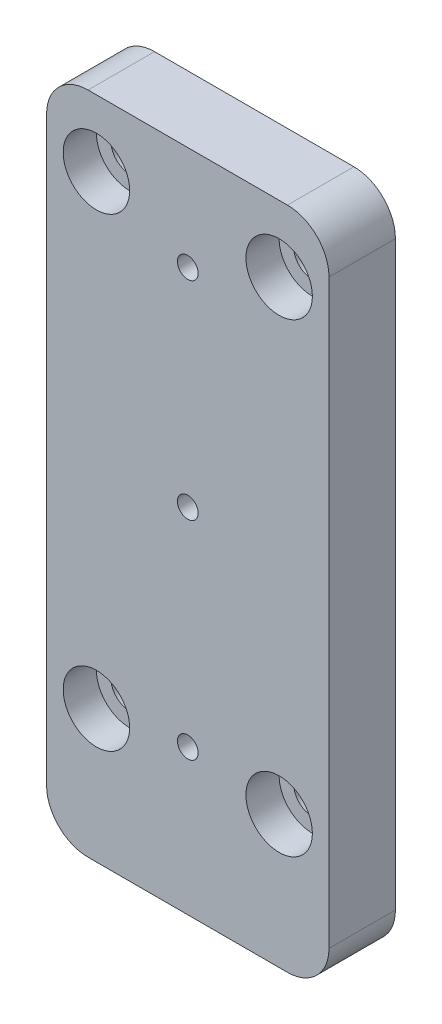
ISO-10303-21;
HEADER;
FILE_DESCRIPTION(('STEP AP214'),'2;1');
FILE_NAME('part.step','',(''),(''),'','','');
FILE_SCHEMA(('AUTOMOTIVE_DESIGN { 1 0 10303 214 1 1 1 1 }'));
ENDSEC;
DATA;
#1=APPLICATION_CONTEXT('core data for automotive mechanical design processes');
#2=APPLICATION_PROTOCOL_DEFINITION('international standard','automotive_design',2000,#1);
#3=PRODUCT_CONTEXT('',#1,'mechanical');
#4=PRODUCT('Part','Part','',(#3));
#5=PRODUCT_RELATED_PRODUCT_CATEGORY('part','',(#4));
#6=PRODUCT_DEFINITION_FORMATION('','',#4);
#7=PRODUCT_DEFINITION_CONTEXT('part definition',#1,'design');
#8=PRODUCT_DEFINITION('design','',#6,#7);
#9=PRODUCT_DEFINITION_SHAPE('','',#8);
#10=(LENGTH_UNIT() NAMED_UNIT(*) SI_UNIT(.MILLI.,.METRE.));
#11=(NAMED_UNIT(*) PLANE_ANGLE_UNIT() SI_UNIT($,.RADIAN.));
#12=(NAMED_UNIT(*) SI_UNIT($,.STERADIAN.) SOLID_ANGLE_UNIT());
#13=UNCERTAINTY_MEASURE_WITH_UNIT(LENGTH_MEASURE(1.E-05),#10,'distance_accuracy_value','');
#14=(GEOMETRIC_REPRESENTATION_CONTEXT(3) GLOBAL_UNCERTAINTY_ASSIGNED_CONTEXT((#13)) GLOBAL_UNIT_ASSIGNED_CONTEXT((#10,
#11,#12)) REPRESENTATION_CONTEXT('',''));
#15=CARTESIAN_POINT('',(0.,0.,0.));
#16=DIRECTION('',(0.,0.,1.));
#17=DIRECTION('',(1.,0.,0.));
#18=AXIS2_PLACEMENT_3D('',#15,#16,#17);
#19=CARTESIAN_POINT('',(6.,72.,0.));
#20=DIRECTION('',(0.,0.,1.));
#21=DIRECTION('',(1.,0.,0.));
#22=AXIS2_PLACEMENT_3D('',#19,#20,#21);
#23=CYLINDRICAL_SURFACE('',#22,2.25);
#24=CARTESIAN_POINT('',(6.,72.,0.));
#25=DIRECTION('',(0.,0.,1.));
#26=DIRECTION('',(-1.,0.,0.));
#27=AXIS2_PLACEMENT_3D('',#24,#25,#26);
#28=CIRCLE('',#27,2.25);
#29=CARTESIAN_POINT('',(3.75,72.,0.));
#30=VERTEX_POINT('',#29);
#31=EDGE_CURVE('E143',#30,#30,#28,.T.);
#32=ORIENTED_EDGE('',*,*,#31,.F.);
#33=EDGE_LOOP('',(#32));
#34=FACE_BOUND('',#33,.T.);
#35=CARTESIAN_POINT('',(6.,72.,4.));
#36=DIRECTION('',(0.,0.,1.));
#37=DIRECTION('',(1.,0.,0.));
#38=AXIS2_PLACEMENT_3D('',#35,#36,#37);
#39=CIRCLE('',#38,2.25);
#40=CARTESIAN_POINT('',(8.25,72.,4.));
#41=VERTEX_POINT('',#40);
#42=EDGE_CURVE('E152',#41,#41,#39,.F.);
#43=ORIENTED_EDGE('',*,*,#42,.F.);
#44=EDGE_LOOP('',(#43));
#45=FACE_BOUND('',#44,.T.);
#46=ADVANCED_FACE('F32',(#34,#45),#23,.F.);
#47=CARTESIAN_POINT('',(28.,72.,0.));
#48=DIRECTION('',(0.,0.,1.));
#49=DIRECTION('',(1.,0.,0.));
#50=AXIS2_PLACEMENT_3D('',#47,#48,#49);
#51=CYLINDRICAL_SURFACE('',#50,2.25);
#52=CARTESIAN_POINT('',(28.,72.,0.));
#53=DIRECTION('',(0.,0.,1.));
#54=DIRECTION('',(1.,0.,0.));
#55=AXIS2_PLACEMENT_3D('',#52,#53,#54);
#56=CIRCLE('',#55,2.25);
#57=CARTESIAN_POINT('',(30.25,72.,0.));
#58=VERTEX_POINT('',#57);
#59=EDGE_CURVE('E214',#58,#58,#56,.T.);
#60=ORIENTED_EDGE('',*,*,#59,.F.);
#61=EDGE_LOOP('',(#60));
#62=FACE_BOUND('',#61,.T.);
#63=CARTESIAN_POINT('',(28.,72.,4.));
#64=DIRECTION('',(0.,0.,1.));
#65=DIRECTION('',(1.,0.,0.));
#66=AXIS2_PLACEMENT_3D('',#63,#64,#65);
#67=CIRCLE('',#66,2.25);
#68=CARTESIAN_POINT('',(30.25,72.,4.));
#69=VERTEX_POINT('',#68);
#70=EDGE_CURVE('E148',#69,#69,#67,.F.);
#71=ORIENTED_EDGE('',*,*,#70,.F.);
#72=EDGE_LOOP('',(#71));
#73=FACE_BOUND('',#72,.T.);
#74=ADVANCED_FACE('F281',(#62,#73),#51,.F.);
#75=CARTESIAN_POINT('',(28.,16.,0.));
#76=DIRECTION('',(0.,0.,1.));
#77=DIRECTION('',(1.,0.,0.));
#78=AXIS2_PLACEMENT_3D('',#75,#76,#77);
#79=CYLINDRICAL_SURFACE('',#78,2.25);
#80=CARTESIAN_POINT('',(28.,16.,0.));
#81=DIRECTION('',(0.,0.,1.));
#82=DIRECTION('',(-1.,0.,0.));
#83=AXIS2_PLACEMENT_3D('',#80,#81,#82);
#84=CIRCLE('',#83,2.25);
#85=CARTESIAN_POINT('',(25.75,16.,0.));
#86=VERTEX_POINT('',#85);
#87=EDGE_CURVE('E211',#86,#86,#84,.T.);
#88=ORIENTED_EDGE('',*,*,#87,.F.);
#89=EDGE_LOOP('',(#88));
#90=FACE_BOUND('',#89,.T.);
#91=CARTESIAN_POINT('',(28.,16.,4.));
#92=DIRECTION('',(0.,0.,1.));
#93=DIRECTION('',(1.,0.,0.));
#94=AXIS2_PLACEMENT_3D('',#91,#92,#93);
#95=CIRCLE('',#94,2.25);
#96=CARTESIAN_POINT('',(30.25,16.,4.));
#97=VERTEX_POINT('',#96);
#98=EDGE_CURVE('E145',#97,#97,#95,.F.);
#99=ORIENTED_EDGE('',*,*,#98,.F.);
#100=EDGE_LOOP('',(#99));
#101=FACE_BOUND('',#100,.T.);
#102=ADVANCED_FACE('F287',(#90,#101),#79,.F.);
#103=CARTESIAN_POINT('',(6.,16.,0.));
#104=DIRECTION('',(0.,0.,1.));
#105=DIRECTION('',(1.,0.,0.));
#106=AXIS2_PLACEMENT_3D('',#103,#104,#105);
#107=CYLINDRICAL_SURFACE('',#106,2.25);
#108=CARTESIAN_POINT('',(6.,16.,0.));
#109=DIRECTION('',(0.,0.,1.));
#110=DIRECTION('',(1.,0.,0.));
#111=AXIS2_PLACEMENT_3D('',#108,#109,#110);
#112=CIRCLE('',#111,2.25);
#113=CARTESIAN_POINT('',(8.25,16.,0.));
#114=VERTEX_POINT('',#113);
#115=EDGE_CURVE('E206',#114,#114,#112,.T.);
#116=ORIENTED_EDGE('',*,*,#115,.F.);
#117=EDGE_LOOP('',(#116));
#118=FACE_BOUND('',#117,.T.);
#119=CARTESIAN_POINT('',(6.,16.,4.));
#120=DIRECTION('',(0.,0.,1.));
#121=DIRECTION('',(1.,0.,0.));
#122=AXIS2_PLACEMENT_3D('',#119,#120,#121);
#123=CIRCLE('',#122,2.25);
#124=CARTESIAN_POINT('',(8.25,16.,4.));
#125=VERTEX_POINT('',#124);
#126=EDGE_CURVE('E140',#125,#125,#123,.F.);
#127=ORIENTED_EDGE('',*,*,#126,.F.);
#128=EDGE_LOOP('',(#127));
#129=FACE_BOUND('',#128,.T.);
#130=ADVANCED_FACE('F294',(#118,#129),#107,.F.);
#131=CARTESIAN_POINT('',(0.,0.,8.));
#132=DIRECTION('',(1.,0.,0.));
#133=DIRECTION('',(0.,0.,-1.));
#134=AXIS2_PLACEMENT_3D('',#131,#132,#133);
#135=PLANE('',#134);
#136=DIRECTION('',(0.,-1.,0.));
#137=VECTOR('',#136,1.);
#138=CARTESIAN_POINT('',(0.,0.,8.));
#139=LINE('',#138,#137);
#140=CARTESIAN_POINT('',(0.,75.,8.));
#141=VERTEX_POINT('',#140);
#142=CARTESIAN_POINT('',(0.,5.,8.));
#143=VERTEX_POINT('',#142);
#144=EDGE_CURVE('E118',#141,#143,#139,.T.);
#145=ORIENTED_EDGE('',*,*,#144,.F.);
#146=DIRECTION('',(0.,0.,-1.));
#147=VECTOR('',#146,1.);
#148=CARTESIAN_POINT('',(0.,75.,8.));
#149=LINE('',#148,#147);
#150=CARTESIAN_POINT('',(0.,75.,0.));
#151=VERTEX_POINT('',#150);
#152=EDGE_CURVE('E102',#141,#151,#149,.T.);
#153=ORIENTED_EDGE('',*,*,#152,.T.);
#154=DIRECTION('',(0.,-1.,0.));
#155=VECTOR('',#154,1.);
#156=CARTESIAN_POINT('',(0.,0.,0.));
#157=LINE('',#156,#155);
#158=CARTESIAN_POINT('',(0.,5.,0.));
#159=VERTEX_POINT('',#158);
#160=EDGE_CURVE('E115',#151,#159,#157,.T.);
#161=ORIENTED_EDGE('',*,*,#160,.T.);
#162=DIRECTION('',(0.,0.,-1.));
#163=VECTOR('',#162,1.);
#164=CARTESIAN_POINT('',(0.,5.,8.));
#165=LINE('',#164,#163);
#166=EDGE_CURVE('E120',#159,#143,#165,.F.);
#167=ORIENTED_EDGE('',*,*,#166,.T.);
#168=EDGE_LOOP('',(#145,#153,#161,#167));
#169=FACE_BOUND('',#168,.T.);
#170=ADVANCED_FACE('F114',(#169),#135,.F.);
#171=CARTESIAN_POINT('',(0.,0.,8.));
#172=DIRECTION('',(0.,1.,0.));
#173=DIRECTION('',(0.,0.,1.));
#174=AXIS2_PLACEMENT_3D('',#171,#172,#173);
#175=PLANE('',#174);
#176=DIRECTION('',(1.,0.,0.));
#177=VECTOR('',#176,1.);
#178=CARTESIAN_POINT('',(0.,0.,0.));
#179=LINE('',#178,#177);
#180=CARTESIAN_POINT('',(5.,0.,0.));
#181=VERTEX_POINT('',#180);
#182=CARTESIAN_POINT('',(29.,0.,0.));
#183=VERTEX_POINT('',#182);
#184=EDGE_CURVE('E124',#181,#183,#179,.T.);
#185=ORIENTED_EDGE('',*,*,#184,.T.);
#186=DIRECTION('',(0.,0.,-1.));
#187=VECTOR('',#186,1.);
#188=CARTESIAN_POINT('',(29.,0.,8.));
#189=LINE('',#188,#187);
#190=CARTESIAN_POINT('',(29.,0.,8.));
#191=VERTEX_POINT('',#190);
#192=EDGE_CURVE('E11',#183,#191,#189,.F.);
#193=ORIENTED_EDGE('',*,*,#192,.T.);
#194=DIRECTION('',(1.,0.,0.));
#195=VECTOR('',#194,1.);
#196=CARTESIAN_POINT('',(0.,0.,8.));
#197=LINE('',#196,#195);
#198=CARTESIAN_POINT('',(5.,0.,8.));
#199=VERTEX_POINT('',#198);
#200=EDGE_CURVE('E180',#199,#191,#197,.T.);
#201=ORIENTED_EDGE('',*,*,#200,.F.);
#202=DIRECTION('',(0.,0.,-1.));
#203=VECTOR('',#202,1.);
#204=CARTESIAN_POINT('',(5.,0.,8.));
#205=LINE('',#204,#203);
#206=EDGE_CURVE('E40',#199,#181,#205,.T.);
#207=ORIENTED_EDGE('',*,*,#206,.T.);
#208=EDGE_LOOP('',(#185,#193,#201,#207));
#209=FACE_BOUND('',#208,.T.);
#210=ADVANCED_FACE('F178',(#209),#175,.F.);
#211=CARTESIAN_POINT('',(34.,0.,8.));
#212=DIRECTION('',(-1.,0.,0.));
#213=DIRECTION('',(0.,0.,1.));
#214=AXIS2_PLACEMENT_3D('',#211,#212,#213);
#215=PLANE('',#214);
#216=DIRECTION('',(0.,1.,0.));
#217=VECTOR('',#216,1.);
#218=CARTESIAN_POINT('',(34.,0.,0.));
#219=LINE('',#218,#217);
#220=CARTESIAN_POINT('',(34.,5.,0.));
#221=VERTEX_POINT('',#220);
#222=CARTESIAN_POINT('',(34.,75.,0.));
#223=VERTEX_POINT('',#222);
#224=EDGE_CURVE('E128',#221,#223,#219,.T.);
#225=ORIENTED_EDGE('',*,*,#224,.T.);
#226=DIRECTION('',(0.,0.,-1.));
#227=VECTOR('',#226,1.);
#228=CARTESIAN_POINT('',(34.,75.,8.));
#229=LINE('',#228,#227);
#230=CARTESIAN_POINT('',(34.,75.,8.));
#231=VERTEX_POINT('',#230);
#232=EDGE_CURVE('E47',#223,#231,#229,.F.);
#233=ORIENTED_EDGE('',*,*,#232,.T.);
#234=DIRECTION('',(0.,1.,0.));
#235=VECTOR('',#234,1.);
#236=CARTESIAN_POINT('',(34.,0.,8.));
#237=LINE('',#236,#235);
#238=CARTESIAN_POINT('',(34.,5.,8.));
#239=VERTEX_POINT('',#238);
#240=EDGE_CURVE('E188',#239,#231,#237,.T.);
#241=ORIENTED_EDGE('',*,*,#240,.F.);
#242=DIRECTION('',(0.,0.,-1.));
#243=VECTOR('',#242,1.);
#244=CARTESIAN_POINT('',(34.,5.,8.));
#245=LINE('',#244,#243);
#246=EDGE_CURVE('E171',#239,#221,#245,.T.);
#247=ORIENTED_EDGE('',*,*,#246,.T.);
#248=EDGE_LOOP('',(#225,#233,#241,#247));
#249=FACE_BOUND('',#248,.T.);
#250=ADVANCED_FACE('F187',(#249),#215,.F.);
#251=CARTESIAN_POINT('',(0.,80.,8.));
#252=DIRECTION('',(0.,-1.,0.));
#253=DIRECTION('',(0.,0.,-1.));
#254=AXIS2_PLACEMENT_3D('',#251,#252,#253);
#255=PLANE('',#254);
#256=DIRECTION('',(-1.,0.,0.));
#257=VECTOR('',#256,1.);
#258=CARTESIAN_POINT('',(0.,80.,0.));
#259=LINE('',#258,#257);
#260=CARTESIAN_POINT('',(29.,80.,0.));
#261=VERTEX_POINT('',#260);
#262=CARTESIAN_POINT('',(5.,80.,0.));
#263=VERTEX_POINT('',#262);
#264=EDGE_CURVE('E138',#261,#263,#259,.T.);
#265=ORIENTED_EDGE('',*,*,#264,.T.);
#266=DIRECTION('',(0.,0.,-1.));
#267=VECTOR('',#266,1.);
#268=CARTESIAN_POINT('',(5.,80.,8.));
#269=LINE('',#268,#267);
#270=CARTESIAN_POINT('',(5.,80.,8.));
#271=VERTEX_POINT('',#270);
#272=EDGE_CURVE('E103',#263,#271,#269,.F.);
#273=ORIENTED_EDGE('',*,*,#272,.T.);
#274=DIRECTION('',(-1.,0.,0.));
#275=VECTOR('',#274,1.);
#276=CARTESIAN_POINT('',(0.,80.,8.));
#277=LINE('',#276,#275);
#278=CARTESIAN_POINT('',(29.,80.,8.));
#279=VERTEX_POINT('',#278);
#280=EDGE_CURVE('E134',#279,#271,#277,.T.);
#281=ORIENTED_EDGE('',*,*,#280,.F.);
#282=DIRECTION('',(0.,0.,-1.));
#283=VECTOR('',#282,1.);
#284=CARTESIAN_POINT('',(29.,80.,8.));
#285=LINE('',#284,#283);
#286=EDGE_CURVE('E108',#279,#261,#285,.T.);
#287=ORIENTED_EDGE('',*,*,#286,.T.);
#288=EDGE_LOOP('',(#265,#273,#281,#287));
#289=FACE_BOUND('',#288,.T.);
#290=ADVANCED_FACE('F254',(#289),#255,.F.);
#291=CARTESIAN_POINT('',(0.,0.,8.));
#292=DIRECTION('',(0.,0.,-1.));
#293=DIRECTION('',(-1.,0.,0.));
#294=AXIS2_PLACEMENT_3D('',#291,#292,#293);
#295=PLANE('',#294);
#296=CARTESIAN_POINT('',(28.,16.,8.));
#297=DIRECTION('',(0.,0.,1.));
#298=DIRECTION('',(1.,0.,0.));
#299=AXIS2_PLACEMENT_3D('',#296,#297,#298);
#300=CIRCLE('',#299,4.);
#301=CARTESIAN_POINT('',(32.,16.,8.));
#302=VERTEX_POINT('',#301);
#303=EDGE_CURVE('E235',#302,#302,#300,.T.);
#304=ORIENTED_EDGE('',*,*,#303,.F.);
#305=EDGE_LOOP('',(#304));
#306=FACE_BOUND('',#305,.T.);
#307=CARTESIAN_POINT('',(6.,72.,8.));
#308=DIRECTION('',(0.,0.,1.));
#309=DIRECTION('',(1.,0.,0.));
#310=AXIS2_PLACEMENT_3D('',#307,#308,#309);
#311=CIRCLE('',#310,4.);
#312=CARTESIAN_POINT('',(10.,72.,8.));
#313=VERTEX_POINT('',#312);
#314=EDGE_CURVE('E229',#313,#313,#311,.T.);
#315=ORIENTED_EDGE('',*,*,#314,.F.);
#316=EDGE_LOOP('',(#315));
#317=FACE_BOUND('',#316,.T.);
#318=CARTESIAN_POINT('',(28.,72.,8.));
#319=DIRECTION('',(0.,0.,1.));
#320=DIRECTION('',(1.,0.,0.));
#321=AXIS2_PLACEMENT_3D('',#318,#319,#320);
#322=CIRCLE('',#321,4.);
#323=CARTESIAN_POINT('',(32.,72.,8.));
#324=VERTEX_POINT('',#323);
#325=EDGE_CURVE('E223',#324,#324,#322,.T.);
#326=ORIENTED_EDGE('',*,*,#325,.F.);
#327=EDGE_LOOP('',(#326));
#328=FACE_BOUND('',#327,.T.);
#329=CARTESIAN_POINT('',(6.,16.,8.));
#330=DIRECTION('',(0.,0.,1.));
#331=DIRECTION('',(1.,0.,0.));
#332=AXIS2_PLACEMENT_3D('',#329,#330,#331);
#333=CIRCLE('',#332,4.);
#334=CARTESIAN_POINT('',(10.,16.,8.));
#335=VERTEX_POINT('',#334);
#336=EDGE_CURVE('E155',#335,#335,#333,.T.);
#337=ORIENTED_EDGE('',*,*,#336,.F.);
#338=EDGE_LOOP('',(#337));
#339=FACE_BOUND('',#338,.T.);
#340=CARTESIAN_POINT('',(17.,42.5,8.));
#341=DIRECTION('',(0.,0.,-1.));
#342=DIRECTION('',(-1.,0.,0.));
#343=AXIS2_PLACEMENT_3D('',#340,#341,#342);
#344=CIRCLE('',#343,1.25);
#345=CARTESIAN_POINT('',(15.75,42.5,8.));
#346=VERTEX_POINT('',#345);
#347=EDGE_CURVE('E196',#346,#346,#344,.T.);
#348=ORIENTED_EDGE('',*,*,#347,.T.);
#349=EDGE_LOOP('',(#348));
#350=FACE_BOUND('',#349,.T.);
#351=CARTESIAN_POINT('',(17.,67.5,8.));
#352=DIRECTION('',(0.,0.,-1.));
#353=DIRECTION('',(-1.,0.,0.));
#354=AXIS2_PLACEMENT_3D('',#351,#352,#353);
#355=CIRCLE('',#354,1.25);
#356=CARTESIAN_POINT('',(15.75,67.5,8.));
#357=VERTEX_POINT('',#356);
#358=EDGE_CURVE('E199',#357,#357,#355,.T.);
#359=ORIENTED_EDGE('',*,*,#358,.T.);
#360=EDGE_LOOP('',(#359));
#361=FACE_BOUND('',#360,.T.);
#362=CARTESIAN_POINT('',(17.,17.5,8.));
#363=DIRECTION('',(0.,0.,-1.));
#364=DIRECTION('',(-1.,0.,0.));
#365=AXIS2_PLACEMENT_3D('',#362,#363,#364);
#366=CIRCLE('',#365,1.25);
#367=CARTESIAN_POINT('',(15.75,17.5,8.));
#368=VERTEX_POINT('',#367);
#369=EDGE_CURVE('E125',#368,#368,#366,.T.);
#370=ORIENTED_EDGE('',*,*,#369,.T.);
#371=EDGE_LOOP('',(#370));
#372=FACE_BOUND('',#371,.T.);
#373=ORIENTED_EDGE('',*,*,#280,.T.);
#374=CARTESIAN_POINT('',(5.,75.,8.));
#375=DIRECTION('',(0.,0.,-1.));
#376=DIRECTION('',(-1.,0.,0.));
#377=AXIS2_PLACEMENT_3D('',#374,#375,#376);
#378=CIRCLE('',#377,5.);
#379=EDGE_CURVE('E169',#271,#141,#378,.F.);
#380=ORIENTED_EDGE('',*,*,#379,.T.);
#381=ORIENTED_EDGE('',*,*,#144,.T.);
#382=CARTESIAN_POINT('',(5.,5.,8.));
#383=DIRECTION('',(0.,0.,-1.));
#384=DIRECTION('',(-1.,0.,0.));
#385=AXIS2_PLACEMENT_3D('',#382,#383,#384);
#386=CIRCLE('',#385,5.);
#387=EDGE_CURVE('E164',#143,#199,#386,.F.);
#388=ORIENTED_EDGE('',*,*,#387,.T.);
#389=ORIENTED_EDGE('',*,*,#200,.T.);
#390=CARTESIAN_POINT('',(29.,5.,8.));
#391=DIRECTION('',(0.,0.,-1.));
#392=DIRECTION('',(-1.,0.,0.));
#393=AXIS2_PLACEMENT_3D('',#390,#391,#392);
#394=CIRCLE('',#393,5.);
#395=EDGE_CURVE('E54',#191,#239,#394,.F.);
#396=ORIENTED_EDGE('',*,*,#395,.T.);
#397=ORIENTED_EDGE('',*,*,#240,.T.);
#398=CARTESIAN_POINT('',(29.,75.,8.));
#399=DIRECTION('',(0.,0.,-1.));
#400=DIRECTION('',(-1.,0.,0.));
#401=AXIS2_PLACEMENT_3D('',#398,#399,#400);
#402=CIRCLE('',#401,5.);
#403=EDGE_CURVE('E167',#231,#279,#402,.F.);
#404=ORIENTED_EDGE('',*,*,#403,.T.);
#405=EDGE_LOOP('',(#373,#380,#381,#388,#389,#396,#397,#404));
#406=FACE_BOUND('',#405,.T.);
#407=ADVANCED_FACE('F251',(#306,#317,#328,#339,#350,#361,#372,#406),#295,.F.);
#408=CARTESIAN_POINT('',(0.,0.,0.));
#409=DIRECTION('',(0.,0.,-1.));
#410=DIRECTION('',(-1.,0.,0.));
#411=AXIS2_PLACEMENT_3D('',#408,#409,#410);
#412=PLANE('',#411);
#413=ORIENTED_EDGE('',*,*,#87,.T.);
#414=EDGE_LOOP('',(#413));
#415=FACE_BOUND('',#414,.T.);
#416=ORIENTED_EDGE('',*,*,#59,.T.);
#417=EDGE_LOOP('',(#416));
#418=FACE_BOUND('',#417,.T.);
#419=ORIENTED_EDGE('',*,*,#31,.T.);
#420=EDGE_LOOP('',(#419));
#421=FACE_BOUND('',#420,.T.);
#422=ORIENTED_EDGE('',*,*,#115,.T.);
#423=EDGE_LOOP('',(#422));
#424=FACE_BOUND('',#423,.T.);
#425=CARTESIAN_POINT('',(17.,42.5,0.));
#426=DIRECTION('',(0.,0.,1.));
#427=DIRECTION('',(1.,0.,0.));
#428=AXIS2_PLACEMENT_3D('',#425,#426,#427);
#429=CIRCLE('',#428,1.25);
#430=CARTESIAN_POINT('',(18.25,42.5,0.));
#431=VERTEX_POINT('',#430);
#432=EDGE_CURVE('E202',#431,#431,#429,.T.);
#433=ORIENTED_EDGE('',*,*,#432,.T.);
#434=EDGE_LOOP('',(#433));
#435=FACE_BOUND('',#434,.T.);
#436=CARTESIAN_POINT('',(17.,67.5,0.));
#437=DIRECTION('',(0.,0.,1.));
#438=DIRECTION('',(1.,0.,0.));
#439=AXIS2_PLACEMENT_3D('',#436,#437,#438);
#440=CIRCLE('',#439,1.25);
#441=CARTESIAN_POINT('',(18.25,67.5,0.));
#442=VERTEX_POINT('',#441);
#443=EDGE_CURVE('E203',#442,#442,#440,.T.);
#444=ORIENTED_EDGE('',*,*,#443,.T.);
#445=EDGE_LOOP('',(#444));
#446=FACE_BOUND('',#445,.T.);
#447=CARTESIAN_POINT('',(17.,17.5,0.));
#448=DIRECTION('',(0.,0.,1.));
#449=DIRECTION('',(1.,0.,0.));
#450=AXIS2_PLACEMENT_3D('',#447,#448,#449);
#451=CIRCLE('',#450,1.25);
#452=CARTESIAN_POINT('',(18.25,17.5,0.));
#453=VERTEX_POINT('',#452);
#454=EDGE_CURVE('E131',#453,#453,#451,.T.);
#455=ORIENTED_EDGE('',*,*,#454,.T.);
#456=EDGE_LOOP('',(#455));
#457=FACE_BOUND('',#456,.T.);
#458=ORIENTED_EDGE('',*,*,#160,.F.);
#459=CARTESIAN_POINT('',(5.,75.,0.));
#460=DIRECTION('',(0.,0.,-1.));
#461=DIRECTION('',(-1.,0.,0.));
#462=AXIS2_PLACEMENT_3D('',#459,#460,#461);
#463=CIRCLE('',#462,5.);
#464=EDGE_CURVE('E98',#151,#263,#463,.T.);
#465=ORIENTED_EDGE('',*,*,#464,.T.);
#466=ORIENTED_EDGE('',*,*,#264,.F.);
#467=CARTESIAN_POINT('',(29.,75.,0.));
#468=DIRECTION('',(0.,0.,-1.));
#469=DIRECTION('',(-1.,0.,0.));
#470=AXIS2_PLACEMENT_3D('',#467,#468,#469);
#471=CIRCLE('',#470,5.);
#472=EDGE_CURVE('E109',#261,#223,#471,.T.);
#473=ORIENTED_EDGE('',*,*,#472,.T.);
#474=ORIENTED_EDGE('',*,*,#224,.F.);
#475=CARTESIAN_POINT('',(29.,5.,0.));
#476=DIRECTION('',(0.,0.,-1.));
#477=DIRECTION('',(-1.,0.,0.));
#478=AXIS2_PLACEMENT_3D('',#475,#476,#477);
#479=CIRCLE('',#478,5.);
#480=EDGE_CURVE('E158',#221,#183,#479,.T.);
#481=ORIENTED_EDGE('',*,*,#480,.T.);
#482=ORIENTED_EDGE('',*,*,#184,.F.);
#483=CARTESIAN_POINT('',(5.,5.,0.));
#484=DIRECTION('',(0.,0.,-1.));
#485=DIRECTION('',(-1.,0.,0.));
#486=AXIS2_PLACEMENT_3D('',#483,#484,#485);
#487=CIRCLE('',#486,5.);
#488=EDGE_CURVE('E119',#181,#159,#487,.T.);
#489=ORIENTED_EDGE('',*,*,#488,.T.);
#490=EDGE_LOOP('',(#458,#465,#466,#473,#474,#481,#482,#489));
#491=FACE_BOUND('',#490,.T.);
#492=ADVANCED_FACE('F122',(#415,#418,#421,#424,#435,#446,#457,#491),#412,.T.);
#493=CARTESIAN_POINT('',(17.,17.5,0.));
#494=DIRECTION('',(0.,0.,1.));
#495=DIRECTION('',(1.,0.,0.));
#496=AXIS2_PLACEMENT_3D('',#493,#494,#495);
#497=CYLINDRICAL_SURFACE('',#496,1.25);
#498=ORIENTED_EDGE('',*,*,#454,.F.);
#499=EDGE_LOOP('',(#498));
#500=FACE_BOUND('',#499,.T.);
#501=ORIENTED_EDGE('',*,*,#369,.F.);
#502=EDGE_LOOP('',(#501));
#503=FACE_BOUND('',#502,.T.);
#504=ADVANCED_FACE('F306',(#500,#503),#497,.F.);
#505=CARTESIAN_POINT('',(17.,67.5,0.));
#506=DIRECTION('',(0.,0.,1.));
#507=DIRECTION('',(1.,0.,0.));
#508=AXIS2_PLACEMENT_3D('',#505,#506,#507);
#509=CYLINDRICAL_SURFACE('',#508,1.25);
#510=ORIENTED_EDGE('',*,*,#443,.F.);
#511=EDGE_LOOP('',(#510));
#512=FACE_BOUND('',#511,.T.);
#513=ORIENTED_EDGE('',*,*,#358,.F.);
#514=EDGE_LOOP('',(#513));
#515=FACE_BOUND('',#514,.T.);
#516=ADVANCED_FACE('F302',(#512,#515),#509,.F.);
#517=CARTESIAN_POINT('',(17.,42.5,0.));
#518=DIRECTION('',(0.,0.,1.));
#519=DIRECTION('',(1.,0.,0.));
#520=AXIS2_PLACEMENT_3D('',#517,#518,#519);
#521=CYLINDRICAL_SURFACE('',#520,1.25);
#522=ORIENTED_EDGE('',*,*,#432,.F.);
#523=EDGE_LOOP('',(#522));
#524=FACE_BOUND('',#523,.T.);
#525=ORIENTED_EDGE('',*,*,#347,.F.);
#526=EDGE_LOOP('',(#525));
#527=FACE_BOUND('',#526,.T.);
#528=ADVANCED_FACE('F298',(#524,#527),#521,.F.);
#529=CARTESIAN_POINT('',(6.,16.,4.));
#530=DIRECTION('',(0.,0.,1.));
#531=DIRECTION('',(1.,0.,0.));
#532=AXIS2_PLACEMENT_3D('',#529,#530,#531);
#533=PLANE('',#532);
#534=CARTESIAN_POINT('',(6.,16.,4.));
#535=DIRECTION('',(0.,0.,1.));
#536=DIRECTION('',(1.,0.,0.));
#537=AXIS2_PLACEMENT_3D('',#534,#535,#536);
#538=CIRCLE('',#537,4.);
#539=CARTESIAN_POINT('',(10.,16.,4.));
#540=VERTEX_POINT('',#539);
#541=EDGE_CURVE('E144',#540,#540,#538,.T.);
#542=ORIENTED_EDGE('',*,*,#541,.T.);
#543=EDGE_LOOP('',(#542));
#544=FACE_BOUND('',#543,.T.);
#545=ORIENTED_EDGE('',*,*,#126,.T.);
#546=EDGE_LOOP('',(#545));
#547=FACE_BOUND('',#546,.T.);
#548=ADVANCED_FACE('F301',(#544,#547),#533,.T.);
#549=CARTESIAN_POINT('',(6.,16.,4.));
#550=DIRECTION('',(0.,0.,1.));
#551=DIRECTION('',(1.,0.,0.));
#552=AXIS2_PLACEMENT_3D('',#549,#550,#551);
#553=CYLINDRICAL_SURFACE('',#552,4.);
#554=ORIENTED_EDGE('',*,*,#541,.F.);
#555=EDGE_LOOP('',(#554));
#556=FACE_BOUND('',#555,.T.);
#557=ORIENTED_EDGE('',*,*,#336,.T.);
#558=EDGE_LOOP('',(#557));
#559=FACE_BOUND('',#558,.T.);
#560=ADVANCED_FACE('F366',(#556,#559),#553,.F.);
#561=CARTESIAN_POINT('',(28.,16.,4.));
#562=DIRECTION('',(0.,0.,1.));
#563=DIRECTION('',(1.,0.,0.));
#564=AXIS2_PLACEMENT_3D('',#561,#562,#563);
#565=PLANE('',#564);
#566=CARTESIAN_POINT('',(28.,16.,4.));
#567=DIRECTION('',(0.,0.,1.));
#568=DIRECTION('',(1.,0.,0.));
#569=AXIS2_PLACEMENT_3D('',#566,#567,#568);
#570=CIRCLE('',#569,4.);
#571=CARTESIAN_POINT('',(32.,16.,4.));
#572=VERTEX_POINT('',#571);
#573=EDGE_CURVE('E149',#572,#572,#570,.T.);
#574=ORIENTED_EDGE('',*,*,#573,.T.);
#575=EDGE_LOOP('',(#574));
#576=FACE_BOUND('',#575,.T.);
#577=ORIENTED_EDGE('',*,*,#98,.T.);
#578=EDGE_LOOP('',(#577));
#579=FACE_BOUND('',#578,.T.);
#580=ADVANCED_FACE('F241',(#576,#579),#565,.T.);
#581=CARTESIAN_POINT('',(28.,16.,4.));
#582=DIRECTION('',(0.,0.,1.));
#583=DIRECTION('',(1.,0.,0.));
#584=AXIS2_PLACEMENT_3D('',#581,#582,#583);
#585=CYLINDRICAL_SURFACE('',#584,4.);
#586=ORIENTED_EDGE('',*,*,#573,.F.);
#587=EDGE_LOOP('',(#586));
#588=FACE_BOUND('',#587,.T.);
#589=ORIENTED_EDGE('',*,*,#303,.T.);
#590=EDGE_LOOP('',(#589));
#591=FACE_BOUND('',#590,.T.);
#592=ADVANCED_FACE('F244',(#588,#591),#585,.F.);
#593=CARTESIAN_POINT('',(28.,72.,4.));
#594=DIRECTION('',(0.,0.,1.));
#595=DIRECTION('',(1.,0.,0.));
#596=AXIS2_PLACEMENT_3D('',#593,#594,#595);
#597=PLANE('',#596);
#598=CARTESIAN_POINT('',(28.,72.,4.));
#599=DIRECTION('',(0.,0.,1.));
#600=DIRECTION('',(1.,0.,0.));
#601=AXIS2_PLACEMENT_3D('',#598,#599,#600);
#602=CIRCLE('',#601,4.);
#603=CARTESIAN_POINT('',(32.,72.,4.));
#604=VERTEX_POINT('',#603);
#605=EDGE_CURVE('E226',#604,#604,#602,.T.);
#606=ORIENTED_EDGE('',*,*,#605,.T.);
#607=EDGE_LOOP('',(#606));
#608=FACE_BOUND('',#607,.T.);
#609=ORIENTED_EDGE('',*,*,#70,.T.);
#610=EDGE_LOOP('',(#609));
#611=FACE_BOUND('',#610,.T.);
#612=ADVANCED_FACE('F247',(#608,#611),#597,.T.);
#613=CARTESIAN_POINT('',(28.,72.,4.));
#614=DIRECTION('',(0.,0.,1.));
#615=DIRECTION('',(1.,0.,0.));
#616=AXIS2_PLACEMENT_3D('',#613,#614,#615);
#617=CYLINDRICAL_SURFACE('',#616,4.);
#618=ORIENTED_EDGE('',*,*,#605,.F.);
#619=EDGE_LOOP('',(#618));
#620=FACE_BOUND('',#619,.T.);
#621=ORIENTED_EDGE('',*,*,#325,.T.);
#622=EDGE_LOOP('',(#621));
#623=FACE_BOUND('',#622,.T.);
#624=ADVANCED_FACE('F391',(#620,#623),#617,.F.);
#625=CARTESIAN_POINT('',(6.,72.,4.));
#626=DIRECTION('',(0.,0.,1.));
#627=DIRECTION('',(1.,0.,0.));
#628=AXIS2_PLACEMENT_3D('',#625,#626,#627);
#629=PLANE('',#628);
#630=CARTESIAN_POINT('',(6.,72.,4.));
#631=DIRECTION('',(0.,0.,1.));
#632=DIRECTION('',(1.,0.,0.));
#633=AXIS2_PLACEMENT_3D('',#630,#631,#632);
#634=CIRCLE('',#633,4.);
#635=CARTESIAN_POINT('',(10.,72.,4.));
#636=VERTEX_POINT('',#635);
#637=EDGE_CURVE('E232',#636,#636,#634,.T.);
#638=ORIENTED_EDGE('',*,*,#637,.T.);
#639=EDGE_LOOP('',(#638));
#640=FACE_BOUND('',#639,.T.);
#641=ORIENTED_EDGE('',*,*,#42,.T.);
#642=EDGE_LOOP('',(#641));
#643=FACE_BOUND('',#642,.T.);
#644=ADVANCED_FACE('F399',(#640,#643),#629,.T.);
#645=CARTESIAN_POINT('',(6.,72.,4.));
#646=DIRECTION('',(0.,0.,1.));
#647=DIRECTION('',(1.,0.,0.));
#648=AXIS2_PLACEMENT_3D('',#645,#646,#647);
#649=CYLINDRICAL_SURFACE('',#648,4.);
#650=ORIENTED_EDGE('',*,*,#637,.F.);
#651=EDGE_LOOP('',(#650));
#652=FACE_BOUND('',#651,.T.);
#653=ORIENTED_EDGE('',*,*,#314,.T.);
#654=EDGE_LOOP('',(#653));
#655=FACE_BOUND('',#654,.T.);
#656=ADVANCED_FACE('F278',(#652,#655),#649,.F.);
#657=CARTESIAN_POINT('',(5.,75.,8.));
#658=DIRECTION('',(0.,0.,-1.));
#659=DIRECTION('',(-1.,0.,0.));
#660=AXIS2_PLACEMENT_3D('',#657,#658,#659);
#661=CYLINDRICAL_SURFACE('',#660,5.);
#662=ORIENTED_EDGE('',*,*,#379,.F.);
#663=ORIENTED_EDGE('',*,*,#272,.F.);
#664=ORIENTED_EDGE('',*,*,#464,.F.);
#665=ORIENTED_EDGE('',*,*,#152,.F.);
#666=EDGE_LOOP('',(#662,#663,#664,#665));
#667=FACE_BOUND('',#666,.T.);
#668=ADVANCED_FACE('F101',(#667),#661,.T.);
#669=CARTESIAN_POINT('',(29.,75.,8.));
#670=DIRECTION('',(0.,0.,-1.));
#671=DIRECTION('',(-1.,0.,0.));
#672=AXIS2_PLACEMENT_3D('',#669,#670,#671);
#673=CYLINDRICAL_SURFACE('',#672,5.);
#674=ORIENTED_EDGE('',*,*,#403,.F.);
#675=ORIENTED_EDGE('',*,*,#232,.F.);
#676=ORIENTED_EDGE('',*,*,#472,.F.);
#677=ORIENTED_EDGE('',*,*,#286,.F.);
#678=EDGE_LOOP('',(#674,#675,#676,#677));
#679=FACE_BOUND('',#678,.T.);
#680=ADVANCED_FACE('F271',(#679),#673,.T.);
#681=CARTESIAN_POINT('',(29.,5.,8.));
#682=DIRECTION('',(0.,0.,-1.));
#683=DIRECTION('',(-1.,0.,0.));
#684=AXIS2_PLACEMENT_3D('',#681,#682,#683);
#685=CYLINDRICAL_SURFACE('',#684,5.);
#686=ORIENTED_EDGE('',*,*,#395,.F.);
#687=ORIENTED_EDGE('',*,*,#192,.F.);
#688=ORIENTED_EDGE('',*,*,#480,.F.);
#689=ORIENTED_EDGE('',*,*,#246,.F.);
#690=EDGE_LOOP('',(#686,#687,#688,#689));
#691=FACE_BOUND('',#690,.T.);
#692=ADVANCED_FACE('F186',(#691),#685,.T.);
#693=CARTESIAN_POINT('',(5.,5.,8.));
#694=DIRECTION('',(0.,0.,-1.));
#695=DIRECTION('',(-1.,0.,0.));
#696=AXIS2_PLACEMENT_3D('',#693,#694,#695);
#697=CYLINDRICAL_SURFACE('',#696,5.);
#698=ORIENTED_EDGE('',*,*,#387,.F.);
#699=ORIENTED_EDGE('',*,*,#166,.F.);
#700=ORIENTED_EDGE('',*,*,#488,.F.);
#701=ORIENTED_EDGE('',*,*,#206,.F.);
#702=EDGE_LOOP('',(#698,#699,#700,#701));
#703=FACE_BOUND('',#702,.T.);
#704=ADVANCED_FACE('F34',(#703),#697,.T.);
#705=CLOSED_SHELL('',(#46,#74,#102,#130,#170,#210,#250,#290,#407,#492,#504,#516,#528,#548,#560,
#580,#592,#612,#624,#644,#656,#668,#680,#692,#704));
#706=MANIFOLD_SOLID_BREP('B2',#705);
#707=ADVANCED_BREP_SHAPE_REPRESENTATION('',(#18,#706),#14);
#708=SHAPE_DEFINITION_REPRESENTATION(#9,#707);
ENDSEC;
END-ISO-10303-21;
